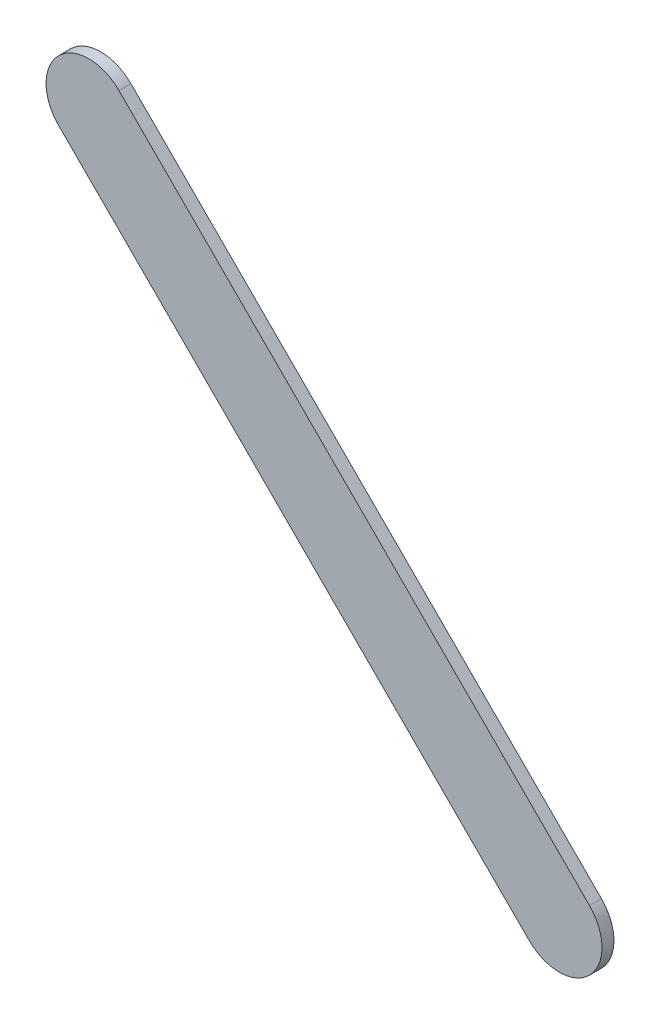
ISO-10303-21;
HEADER;
FILE_DESCRIPTION(('STEP AP214'),'2;1');
FILE_NAME('part.step','',(''),(''),'','','');
FILE_SCHEMA(('AUTOMOTIVE_DESIGN { 1 0 10303 214 1 1 1 1 }'));
ENDSEC;
DATA;
#1=APPLICATION_CONTEXT('core data for automotive mechanical design processes');
#2=APPLICATION_PROTOCOL_DEFINITION('international standard','automotive_design',2000,#1);
#3=PRODUCT_CONTEXT('',#1,'mechanical');
#4=PRODUCT('Part','Part','',(#3));
#5=PRODUCT_RELATED_PRODUCT_CATEGORY('part','',(#4));
#6=PRODUCT_DEFINITION_FORMATION('','',#4);
#7=PRODUCT_DEFINITION_CONTEXT('part definition',#1,'design');
#8=PRODUCT_DEFINITION('design','',#6,#7);
#9=PRODUCT_DEFINITION_SHAPE('','',#8);
#10=(LENGTH_UNIT() NAMED_UNIT(*) SI_UNIT(.MILLI.,.METRE.));
#11=(NAMED_UNIT(*) PLANE_ANGLE_UNIT() SI_UNIT($,.RADIAN.));
#12=(NAMED_UNIT(*) SI_UNIT($,.STERADIAN.) SOLID_ANGLE_UNIT());
#13=UNCERTAINTY_MEASURE_WITH_UNIT(LENGTH_MEASURE(1.E-05),#10,'distance_accuracy_value','');
#14=(GEOMETRIC_REPRESENTATION_CONTEXT(3) GLOBAL_UNCERTAINTY_ASSIGNED_CONTEXT((#13)) GLOBAL_UNIT_ASSIGNED_CONTEXT((#10,
#11,#12)) REPRESENTATION_CONTEXT('',''));
#15=CARTESIAN_POINT('',(0.,0.,0.));
#16=DIRECTION('',(0.,0.,1.));
#17=DIRECTION('',(1.,0.,0.));
#18=AXIS2_PLACEMENT_3D('',#15,#16,#17);
#19=CARTESIAN_POINT('',(91.2272115,98.99712992,0.));
#20=DIRECTION('',(0.707106781186548,0.707106781186548,0.));
#21=DIRECTION('',(0.707106781186548,-0.707106781186548,0.));
#22=AXIS2_PLACEMENT_3D('',#19,#20,#21);
#23=PLANE('',#22);
#24=DIRECTION('',(0.707106781186548,-0.707106781186548,0.));
#25=VECTOR('',#24,1.);
#26=CARTESIAN_POINT('',(91.2272115,98.99712992,0.03556));
#27=LINE('',#26,#25);
#28=CARTESIAN_POINT('',(91.2272115,98.99712992,0.03556));
#29=VERTEX_POINT('',#28);
#30=CARTESIAN_POINT('',(92.6271706,97.59717082,0.03556));
#31=VERTEX_POINT('',#30);
#32=EDGE_CURVE('E11',#29,#31,#27,.T.);
#33=ORIENTED_EDGE('',*,*,#32,.F.);
#34=DIRECTION('',(0.,0.,1.));
#35=VECTOR('',#34,1.);
#36=CARTESIAN_POINT('',(91.2272115,98.99712992,0.));
#37=LINE('',#36,#35);
#38=CARTESIAN_POINT('',(91.2272115,98.99712992,0.));
#39=VERTEX_POINT('',#38);
#40=EDGE_CURVE('E24',#39,#29,#37,.T.);
#41=ORIENTED_EDGE('',*,*,#40,.F.);
#42=DIRECTION('',(0.707106781186548,-0.707106781186548,0.));
#43=VECTOR('',#42,1.);
#44=CARTESIAN_POINT('',(91.2272115,98.99712992,0.));
#45=LINE('',#44,#43);
#46=CARTESIAN_POINT('',(92.6271706,97.59717082,0.));
#47=VERTEX_POINT('',#46);
#48=EDGE_CURVE('E75',#39,#47,#45,.T.);
#49=ORIENTED_EDGE('',*,*,#48,.T.);
#50=DIRECTION('',(0.,0.,1.));
#51=VECTOR('',#50,1.);
#52=CARTESIAN_POINT('',(92.6271706,97.59717082,0.));
#53=LINE('',#52,#51);
#54=EDGE_CURVE('E37',#47,#31,#53,.T.);
#55=ORIENTED_EDGE('',*,*,#54,.T.);
#56=EDGE_LOOP('',(#33,#41,#49,#55));
#57=FACE_BOUND('',#56,.T.);
#58=ADVANCED_FACE('F17',(#57),#23,.F.);
#59=CARTESIAN_POINT('',(92.71697357,97.68697252,0.));
#60=DIRECTION('',(0.,0.,-1.));
#61=DIRECTION('',(-0.707111781181459,-0.707101781156281,0.));
#62=AXIS2_PLACEMENT_3D('',#59,#60,#61);
#63=CYLINDRICAL_SURFACE('',#62,0.126999680092939);
#64=CARTESIAN_POINT('',(92.71697357,97.68697252,0.03556));
#65=DIRECTION('',(0.,0.,1.));
#66=DIRECTION('',(-0.707111781181459,-0.707101781156281,0.));
#67=AXIS2_PLACEMENT_3D('',#64,#65,#66);
#68=CIRCLE('',#67,0.126999680092939);
#69=CARTESIAN_POINT('',(92.80677654,97.77677422,0.03556));
#70=VERTEX_POINT('',#69);
#71=EDGE_CURVE('E83',#31,#70,#68,.T.);
#72=ORIENTED_EDGE('',*,*,#71,.F.);
#73=ORIENTED_EDGE('',*,*,#54,.F.);
#74=CARTESIAN_POINT('',(92.71697357,97.68697252,0.));
#75=DIRECTION('',(0.,0.,1.));
#76=DIRECTION('',(-0.707111781181459,-0.707101781156281,0.));
#77=AXIS2_PLACEMENT_3D('',#74,#75,#76);
#78=CIRCLE('',#77,0.126999680092939);
#79=CARTESIAN_POINT('',(92.80677654,97.77677422,0.));
#80=VERTEX_POINT('',#79);
#81=EDGE_CURVE('E81',#47,#80,#78,.T.);
#82=ORIENTED_EDGE('',*,*,#81,.T.);
#83=DIRECTION('',(0.,0.,1.));
#84=VECTOR('',#83,1.);
#85=CARTESIAN_POINT('',(92.80677654,97.77677422,0.));
#86=LINE('',#85,#84);
#87=EDGE_CURVE('E67',#80,#70,#86,.T.);
#88=ORIENTED_EDGE('',*,*,#87,.T.);
#89=EDGE_LOOP('',(#72,#73,#82,#88));
#90=FACE_BOUND('',#89,.T.);
#91=ADVANCED_FACE('F89',(#90),#63,.T.);
#92=CARTESIAN_POINT('',(92.80677654,97.77677422,0.));
#93=DIRECTION('',(-0.707106781186551,-0.707106781186544,0.));
#94=DIRECTION('',(-0.707106781186544,0.707106781186551,0.));
#95=AXIS2_PLACEMENT_3D('',#92,#93,#94);
#96=PLANE('',#95);
#97=DIRECTION('',(-0.707106781186544,0.707106781186551,0.));
#98=VECTOR('',#97,1.);
#99=CARTESIAN_POINT('',(92.80677654,97.77677422,0.03556));
#100=LINE('',#99,#98);
#101=CARTESIAN_POINT('',(91.4068149,99.17673586,0.03556));
#102=VERTEX_POINT('',#101);
#103=EDGE_CURVE('E71',#70,#102,#100,.T.);
#104=ORIENTED_EDGE('',*,*,#103,.F.);
#105=ORIENTED_EDGE('',*,*,#87,.F.);
#106=DIRECTION('',(-0.707106781186544,0.707106781186551,0.));
#107=VECTOR('',#106,1.);
#108=CARTESIAN_POINT('',(92.80677654,97.77677422,0.));
#109=LINE('',#108,#107);
#110=CARTESIAN_POINT('',(91.4068149,99.17673586,0.));
#111=VERTEX_POINT('',#110);
#112=EDGE_CURVE('E63',#80,#111,#109,.T.);
#113=ORIENTED_EDGE('',*,*,#112,.T.);
#114=DIRECTION('',(0.,0.,1.));
#115=VECTOR('',#114,1.);
#116=CARTESIAN_POINT('',(91.4068149,99.17673586,0.));
#117=LINE('',#116,#115);
#118=EDGE_CURVE('E53',#111,#102,#117,.T.);
#119=ORIENTED_EDGE('',*,*,#118,.T.);
#120=EDGE_LOOP('',(#104,#105,#113,#119));
#121=FACE_BOUND('',#120,.T.);
#122=ADVANCED_FACE('F66',(#121),#96,.F.);
#123=CARTESIAN_POINT('',(91.3170132,99.08693289,0.));
#124=DIRECTION('',(0.,0.,-1.));
#125=DIRECTION('',(0.707101781156337,0.707111781181403,0.));
#126=AXIS2_PLACEMENT_3D('',#123,#124,#125);
#127=CYLINDRICAL_SURFACE('',#126,0.126999680092943);
#128=CARTESIAN_POINT('',(91.3170132,99.08693289,0.03556));
#129=DIRECTION('',(0.,0.,1.));
#130=DIRECTION('',(0.707101781156337,0.707111781181403,0.));
#131=AXIS2_PLACEMENT_3D('',#128,#129,#130);
#132=CIRCLE('',#131,0.126999680092943);
#133=EDGE_CURVE('E59',#102,#29,#132,.T.);
#134=ORIENTED_EDGE('',*,*,#133,.F.);
#135=ORIENTED_EDGE('',*,*,#118,.F.);
#136=CARTESIAN_POINT('',(91.3170132,99.08693289,0.));
#137=DIRECTION('',(0.,0.,1.));
#138=DIRECTION('',(0.707101781156337,0.707111781181403,0.));
#139=AXIS2_PLACEMENT_3D('',#136,#137,#138);
#140=CIRCLE('',#139,0.126999680092943);
#141=EDGE_CURVE('E57',#111,#39,#140,.T.);
#142=ORIENTED_EDGE('',*,*,#141,.T.);
#143=ORIENTED_EDGE('',*,*,#40,.T.);
#144=EDGE_LOOP('',(#134,#135,#142,#143));
#145=FACE_BOUND('',#144,.T.);
#146=ADVANCED_FACE('F55',(#145),#127,.T.);
#147=CARTESIAN_POINT('',(91.2272115,98.99712992,0.));
#148=DIRECTION('',(0.,0.,-1.));
#149=DIRECTION('',(-1.,0.,0.));
#150=AXIS2_PLACEMENT_3D('',#147,#148,#149);
#151=PLANE('',#150);
#152=ORIENTED_EDGE('',*,*,#141,.F.);
#153=ORIENTED_EDGE('',*,*,#112,.F.);
#154=ORIENTED_EDGE('',*,*,#81,.F.);
#155=ORIENTED_EDGE('',*,*,#48,.F.);
#156=EDGE_LOOP('',(#152,#153,#154,#155));
#157=FACE_BOUND('',#156,.T.);
#158=ADVANCED_FACE('F74',(#157),#151,.T.);
#159=CARTESIAN_POINT('',(91.2272115,98.99712992,0.03556));
#160=DIRECTION('',(0.,0.,-1.));
#161=DIRECTION('',(-1.,0.,0.));
#162=AXIS2_PLACEMENT_3D('',#159,#160,#161);
#163=PLANE('',#162);
#164=ORIENTED_EDGE('',*,*,#32,.T.);
#165=ORIENTED_EDGE('',*,*,#71,.T.);
#166=ORIENTED_EDGE('',*,*,#103,.T.);
#167=ORIENTED_EDGE('',*,*,#133,.T.);
#168=EDGE_LOOP('',(#164,#165,#166,#167));
#169=FACE_BOUND('',#168,.T.);
#170=ADVANCED_FACE('F91',(#169),#163,.F.);
#171=CLOSED_SHELL('',(#58,#91,#122,#146,#158,#170));
#172=MANIFOLD_SOLID_BREP('B1',#171);
#173=ADVANCED_BREP_SHAPE_REPRESENTATION('',(#18,#172),#14);
#174=SHAPE_DEFINITION_REPRESENTATION(#9,#173);
ENDSEC;
END-ISO-10303-21;
